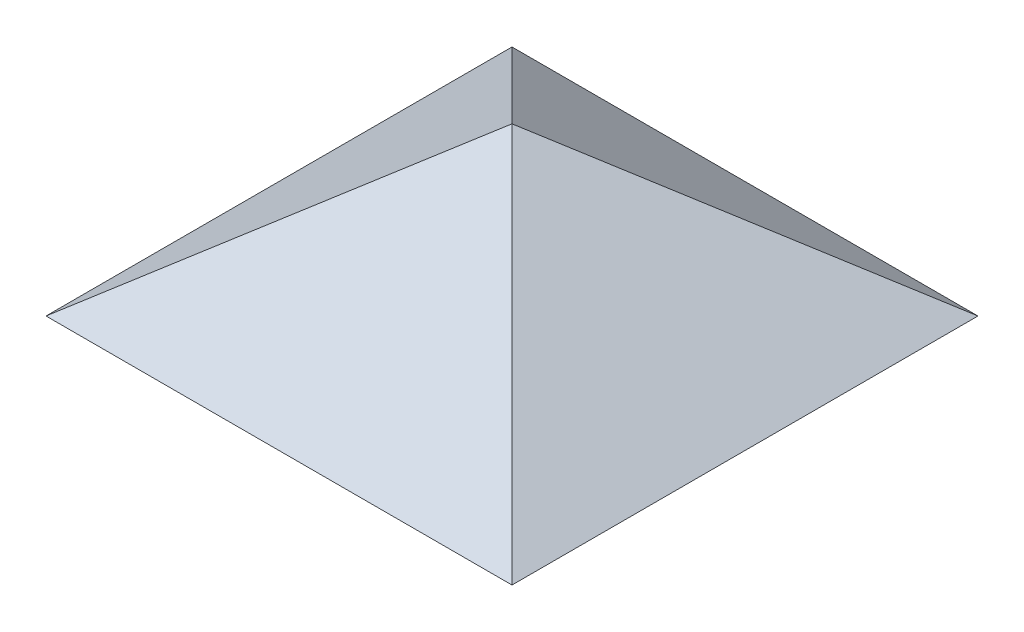
ISO-10303-21;
HEADER;
FILE_DESCRIPTION(('STEP AP214'),'2;1');
FILE_NAME('part.step','',(''),(''),'','','');
FILE_SCHEMA(('AUTOMOTIVE_DESIGN { 1 0 10303 214 1 1 1 1 }'));
ENDSEC;
DATA;
#1=APPLICATION_CONTEXT('core data for automotive mechanical design processes');
#2=APPLICATION_PROTOCOL_DEFINITION('international standard','automotive_design',2000,#1);
#3=PRODUCT_CONTEXT('',#1,'mechanical');
#4=PRODUCT('Part','Part','',(#3));
#5=PRODUCT_RELATED_PRODUCT_CATEGORY('part','',(#4));
#6=PRODUCT_DEFINITION_FORMATION('','',#4);
#7=PRODUCT_DEFINITION_CONTEXT('part definition',#1,'design');
#8=PRODUCT_DEFINITION('design','',#6,#7);
#9=PRODUCT_DEFINITION_SHAPE('','',#8);
#10=(LENGTH_UNIT() NAMED_UNIT(*) SI_UNIT(.MILLI.,.METRE.));
#11=(NAMED_UNIT(*) PLANE_ANGLE_UNIT() SI_UNIT($,.RADIAN.));
#12=(NAMED_UNIT(*) SI_UNIT($,.STERADIAN.) SOLID_ANGLE_UNIT());
#13=UNCERTAINTY_MEASURE_WITH_UNIT(LENGTH_MEASURE(1.E-05),#10,'distance_accuracy_value','');
#14=(GEOMETRIC_REPRESENTATION_CONTEXT(3) GLOBAL_UNCERTAINTY_ASSIGNED_CONTEXT((#13)) GLOBAL_UNIT_ASSIGNED_CONTEXT((#10,
#11,#12)) REPRESENTATION_CONTEXT('',''));
#15=CARTESIAN_POINT('',(0.,0.,0.));
#16=DIRECTION('',(0.,0.,1.));
#17=DIRECTION('',(1.,0.,0.));
#18=AXIS2_PLACEMENT_3D('',#15,#16,#17);
#19=CARTESIAN_POINT('',(0.,827.702702702702,-591.216216216216));
#20=DIRECTION('',(0.,-0.813733471206735,0.581238193719096));
#21=DIRECTION('',(0.,-0.581238193719096,-0.813733471206735));
#22=AXIS2_PLACEMENT_3D('',#19,#20,#21);
#23=PLANE('',#22);
#24=DIRECTION('',(1.,0.,0.));
#25=VECTOR('',#24,1.);
#26=CARTESIAN_POINT('',(-1750.,0.,-1750.));
#27=LINE('',#26,#25);
#28=CARTESIAN_POINT('',(-1750.,-4.44089209850063E-13,-1750.));
#29=VERTEX_POINT('',#28);
#30=CARTESIAN_POINT('',(1750.,0.,-1750.));
#31=VERTEX_POINT('',#30);
#32=EDGE_CURVE('E131',#29,#31,#27,.T.);
#33=ORIENTED_EDGE('',*,*,#32,.F.);
#34=DIRECTION('',(-0.631168744267202,-0.450834817333716,-0.631168744267203));
#35=VECTOR('',#34,1.);
#36=CARTESIAN_POINT('',(0.,1250.,0.));
#37=LINE('',#36,#35);
#38=CARTESIAN_POINT('',(0.,1250.,0.));
#39=VERTEX_POINT('',#38);
#40=EDGE_CURVE('E13',#39,#29,#37,.T.);
#41=ORIENTED_EDGE('',*,*,#40,.F.);
#42=DIRECTION('',(-0.631168744267203,0.450834817333716,0.631168744267203));
#43=VECTOR('',#42,1.);
#44=CARTESIAN_POINT('',(0.,1250.,0.));
#45=LINE('',#44,#43);
#46=EDGE_CURVE('E81',#31,#39,#45,.T.);
#47=ORIENTED_EDGE('',*,*,#46,.F.);
#48=EDGE_LOOP('',(#33,#41,#47));
#49=FACE_BOUND('',#48,.T.);
#50=ADVANCED_FACE('F71',(#49),#23,.F.);
#51=CARTESIAN_POINT('',(0.,649.500384319754,-624.519600307456));
#52=DIRECTION('',(0.,-0.720833064901856,0.693108716251784));
#53=DIRECTION('',(0.,-0.693108716251784,-0.720833064901856));
#54=AXIS2_PLACEMENT_3D('',#51,#52,#53);
#55=PLANE('',#54);
#56=DIRECTION('',(1.,0.,0.));
#57=VECTOR('',#56,1.);
#58=CARTESIAN_POINT('',(-1300.,0.,-1300.));
#59=LINE('',#58,#57);
#60=CARTESIAN_POINT('',(-1300.,0.,-1300.));
#61=VERTEX_POINT('',#60);
#62=CARTESIAN_POINT('',(1300.,2.22044604925031E-13,-1300.));
#63=VERTEX_POINT('',#62);
#64=EDGE_CURVE('E111',#61,#63,#59,.T.);
#65=ORIENTED_EDGE('',*,*,#64,.T.);
#66=DIRECTION('',(-0.584749707598188,0.562259334229027,0.584749707598188));
#67=VECTOR('',#66,1.);
#68=CARTESIAN_POINT('',(0.,1250.,0.));
#69=LINE('',#68,#67);
#70=EDGE_CURVE('E114',#63,#39,#69,.T.);
#71=ORIENTED_EDGE('',*,*,#70,.T.);
#72=DIRECTION('',(-0.584749707598188,-0.562259334229027,-0.584749707598188));
#73=VECTOR('',#72,1.);
#74=CARTESIAN_POINT('',(0.,1250.,0.));
#75=LINE('',#74,#73);
#76=EDGE_CURVE('E108',#39,#61,#75,.T.);
#77=ORIENTED_EDGE('',*,*,#76,.T.);
#78=EDGE_LOOP('',(#65,#71,#77));
#79=FACE_BOUND('',#78,.T.);
#80=ADVANCED_FACE('F110',(#79),#55,.T.);
#81=CARTESIAN_POINT('',(0.,8.63506796930678E-13,0.));
#82=DIRECTION('',(0.,-1.,0.));
#83=DIRECTION('',(0.,0.,-1.));
#84=AXIS2_PLACEMENT_3D('',#81,#82,#83);
#85=PLANE('',#84);
#86=DIRECTION('',(-0.707106781186547,0.,-0.707106781186548));
#87=VECTOR('',#86,1.);
#88=CARTESIAN_POINT('',(-1300.,0.,-1300.));
#89=LINE('',#88,#87);
#90=EDGE_CURVE('E96',#61,#29,#89,.T.);
#91=ORIENTED_EDGE('',*,*,#90,.T.);
#92=ORIENTED_EDGE('',*,*,#32,.T.);
#93=DIRECTION('',(0.707106781186548,0.,-0.707106781186547));
#94=VECTOR('',#93,1.);
#95=CARTESIAN_POINT('',(1300.,2.22044604925031E-13,-1300.));
#96=LINE('',#95,#94);
#97=EDGE_CURVE('E124',#63,#31,#96,.T.);
#98=ORIENTED_EDGE('',*,*,#97,.F.);
#99=ORIENTED_EDGE('',*,*,#64,.F.);
#100=EDGE_LOOP('',(#91,#92,#98,#99));
#101=FACE_BOUND('',#100,.T.);
#102=ADVANCED_FACE('F122',(#101),#85,.T.);
#103=CARTESIAN_POINT('',(0.,1250.,0.));
#104=DIRECTION('',(0.707106781186547,0.,0.707106781186548));
#105=DIRECTION('',(0.584749707598188,-0.562259334229026,-0.584749707598188));
#106=AXIS2_PLACEMENT_3D('',#103,#104,#105);
#107=PLANE('',#106);
#108=ORIENTED_EDGE('',*,*,#70,.F.);
#109=ORIENTED_EDGE('',*,*,#97,.T.);
#110=ORIENTED_EDGE('',*,*,#46,.T.);
#111=EDGE_LOOP('',(#108,#109,#110));
#112=FACE_BOUND('',#111,.T.);
#113=ADVANCED_FACE('F144',(#112),#107,.T.);
#114=CARTESIAN_POINT('',(-1300.,0.,-1300.));
#115=DIRECTION('',(-0.707106781186548,0.,0.707106781186547));
#116=DIRECTION('',(0.584749707598188,0.562259334229027,0.584749707598188));
#117=AXIS2_PLACEMENT_3D('',#114,#115,#116);
#118=PLANE('',#117);
#119=ORIENTED_EDGE('',*,*,#76,.F.);
#120=ORIENTED_EDGE('',*,*,#40,.T.);
#121=ORIENTED_EDGE('',*,*,#90,.F.);
#122=EDGE_LOOP('',(#119,#120,#121));
#123=FACE_BOUND('',#122,.T.);
#124=ADVANCED_FACE('F128',(#123),#118,.T.);
#125=CLOSED_SHELL('',(#50,#80,#102,#113,#124));
#126=MANIFOLD_SOLID_BREP('B2',#125);
#127=CARTESIAN_POINT('',(0.,649.500384319754,624.519600307456));
#128=DIRECTION('',(0.,0.720833064901856,0.693108716251784));
#129=DIRECTION('',(0.,-0.693108716251784,0.720833064901856));
#130=AXIS2_PLACEMENT_3D('',#127,#128,#129);
#131=PLANE('',#130);
#132=DIRECTION('',(1.,0.,0.));
#133=VECTOR('',#132,1.);
#134=CARTESIAN_POINT('',(-1300.,0.,1300.));
#135=LINE('',#134,#133);
#136=CARTESIAN_POINT('',(-1300.,0.,1300.));
#137=VERTEX_POINT('',#136);
#138=CARTESIAN_POINT('',(1300.,0.,1300.));
#139=VERTEX_POINT('',#138);
#140=EDGE_CURVE('E479',#137,#139,#135,.T.);
#141=ORIENTED_EDGE('',*,*,#140,.F.);
#142=DIRECTION('',(-0.584749707598188,-0.562259334229027,0.584749707598188));
#143=VECTOR('',#142,1.);
#144=CARTESIAN_POINT('',(0.,1250.,0.));
#145=LINE('',#144,#143);
#146=CARTESIAN_POINT('',(0.,1250.,0.));
#147=VERTEX_POINT('',#146);
#148=EDGE_CURVE('E69',#147,#137,#145,.T.);
#149=ORIENTED_EDGE('',*,*,#148,.F.);
#150=DIRECTION('',(-0.584749707598187,0.562259334229027,-0.584749707598188));
#151=VECTOR('',#150,1.);
#152=CARTESIAN_POINT('',(0.,1250.,0.));
#153=LINE('',#152,#151);
#154=EDGE_CURVE('E309',#139,#147,#153,.T.);
#155=ORIENTED_EDGE('',*,*,#154,.F.);
#156=EDGE_LOOP('',(#141,#149,#155));
#157=FACE_BOUND('',#156,.T.);
#158=ADVANCED_FACE('F299',(#157),#131,.F.);
#159=CARTESIAN_POINT('',(1.15335668943323E-13,827.702702702703,591.216216216216));
#160=DIRECTION('',(0.,-0.813733471206735,-0.581238193719096));
#161=DIRECTION('',(0.,0.581238193719096,-0.813733471206735));
#162=AXIS2_PLACEMENT_3D('',#159,#160,#161);
#163=PLANE('',#162);
#164=DIRECTION('',(-0.631168744267203,-0.450834817333716,0.631168744267203));
#165=VECTOR('',#164,1.);
#166=CARTESIAN_POINT('',(0.,1250.,0.));
#167=LINE('',#166,#165);
#168=CARTESIAN_POINT('',(-1750.,0.,1750.));
#169=VERTEX_POINT('',#168);
#170=EDGE_CURVE('E418',#147,#169,#167,.T.);
#171=ORIENTED_EDGE('',*,*,#170,.T.);
#172=DIRECTION('',(1.,0.,0.));
#173=VECTOR('',#172,1.);
#174=CARTESIAN_POINT('',(-1750.,0.,1750.));
#175=LINE('',#174,#173);
#176=CARTESIAN_POINT('',(1750.,-2.22044604925031E-13,1750.));
#177=VERTEX_POINT('',#176);
#178=EDGE_CURVE('E317',#169,#177,#175,.T.);
#179=ORIENTED_EDGE('',*,*,#178,.T.);
#180=DIRECTION('',(-0.631168744267202,0.450834817333716,-0.631168744267203));
#181=VECTOR('',#180,1.);
#182=CARTESIAN_POINT('',(0.,1250.,0.));
#183=LINE('',#182,#181);
#184=EDGE_CURVE('E326',#177,#147,#183,.T.);
#185=ORIENTED_EDGE('',*,*,#184,.T.);
#186=EDGE_LOOP('',(#171,#179,#185));
#187=FACE_BOUND('',#186,.T.);
#188=ADVANCED_FACE('F435',(#187),#163,.F.);
#189=CARTESIAN_POINT('',(-1750.,0.,1750.));
#190=DIRECTION('',(0.,1.,0.));
#191=DIRECTION('',(0.,0.,1.));
#192=AXIS2_PLACEMENT_3D('',#189,#190,#191);
#193=PLANE('',#192);
#194=ORIENTED_EDGE('',*,*,#140,.T.);
#195=DIRECTION('',(0.,0.,1.));
#196=VECTOR('',#195,1.);
#197=CARTESIAN_POINT('',(1300.,0.,-1300.));
#198=LINE('',#197,#196);
#199=CARTESIAN_POINT('',(1300.,0.,-1300.));
#200=VERTEX_POINT('',#199);
#201=EDGE_CURVE('E353',#200,#139,#198,.T.);
#202=ORIENTED_EDGE('',*,*,#201,.F.);
#203=DIRECTION('',(-0.707106781186548,0.,0.707106781186548));
#204=VECTOR('',#203,1.);
#205=CARTESIAN_POINT('',(1750.,0.,-1750.));
#206=LINE('',#205,#204);
#207=CARTESIAN_POINT('',(1750.,0.,-1750.));
#208=VERTEX_POINT('',#207);
#209=EDGE_CURVE('E348',#208,#200,#206,.T.);
#210=ORIENTED_EDGE('',*,*,#209,.F.);
#211=DIRECTION('',(0.,0.,1.));
#212=VECTOR('',#211,1.);
#213=CARTESIAN_POINT('',(1750.,0.,-1750.));
#214=LINE('',#213,#212);
#215=EDGE_CURVE('E352',#208,#177,#214,.T.);
#216=ORIENTED_EDGE('',*,*,#215,.T.);
#217=ORIENTED_EDGE('',*,*,#178,.F.);
#218=DIRECTION('',(0.,0.,-1.));
#219=VECTOR('',#218,1.);
#220=CARTESIAN_POINT('',(-1750.,0.,1750.));
#221=LINE('',#220,#219);
#222=CARTESIAN_POINT('',(-1750.,-2.22044604925031E-13,-1750.));
#223=VERTEX_POINT('',#222);
#224=EDGE_CURVE('E484',#169,#223,#221,.T.);
#225=ORIENTED_EDGE('',*,*,#224,.T.);
#226=DIRECTION('',(-0.707106781186548,0.,-0.707106781186548));
#227=VECTOR('',#226,1.);
#228=CARTESIAN_POINT('',(0.,0.,1.11022302462516E-12));
#229=LINE('',#228,#227);
#230=CARTESIAN_POINT('',(-1300.,0.,-1300.));
#231=VERTEX_POINT('',#230);
#232=EDGE_CURVE('E483',#231,#223,#229,.T.);
#233=ORIENTED_EDGE('',*,*,#232,.F.);
#234=DIRECTION('',(0.,0.,-1.));
#235=VECTOR('',#234,1.);
#236=CARTESIAN_POINT('',(-1300.,0.,1300.));
#237=LINE('',#236,#235);
#238=EDGE_CURVE('E499',#137,#231,#237,.T.);
#239=ORIENTED_EDGE('',*,*,#238,.F.);
#240=EDGE_LOOP('',(#194,#202,#210,#216,#217,#225,#233,#239));
#241=FACE_BOUND('',#240,.T.);
#242=ADVANCED_FACE('F351',(#241),#193,.F.);
#243=CARTESIAN_POINT('',(-624.519600307456,649.500384319754,1.38671207918207E-13));
#244=DIRECTION('',(-0.693108716251784,0.720833064901856,0.));
#245=DIRECTION('',(-0.720833064901856,-0.693108716251784,0.));
#246=AXIS2_PLACEMENT_3D('',#243,#244,#245);
#247=PLANE('',#246);
#248=ORIENTED_EDGE('',*,*,#238,.T.);
#249=DIRECTION('',(0.584749707598188,0.562259334229027,0.584749707598187));
#250=VECTOR('',#249,1.);
#251=CARTESIAN_POINT('',(0.,1250.,0.));
#252=LINE('',#251,#250);
#253=EDGE_CURVE('E530',#231,#147,#252,.T.);
#254=ORIENTED_EDGE('',*,*,#253,.T.);
#255=ORIENTED_EDGE('',*,*,#148,.T.);
#256=EDGE_LOOP('',(#248,#254,#255));
#257=FACE_BOUND('',#256,.T.);
#258=ADVANCED_FACE('F444',(#257),#247,.F.);
#259=CARTESIAN_POINT('',(-591.216216216216,827.702702702703,0.));
#260=DIRECTION('',(0.581238193719096,-0.813733471206735,0.));
#261=DIRECTION('',(0.813733471206735,0.581238193719096,0.));
#262=AXIS2_PLACEMENT_3D('',#259,#260,#261);
#263=PLANE('',#262);
#264=ORIENTED_EDGE('',*,*,#170,.F.);
#265=DIRECTION('',(0.631168744267203,0.450834817333716,0.631168744267202));
#266=VECTOR('',#265,1.);
#267=CARTESIAN_POINT('',(0.,1250.,0.));
#268=LINE('',#267,#266);
#269=EDGE_CURVE('E480',#223,#147,#268,.T.);
#270=ORIENTED_EDGE('',*,*,#269,.F.);
#271=ORIENTED_EDGE('',*,*,#224,.F.);
#272=EDGE_LOOP('',(#264,#270,#271));
#273=FACE_BOUND('',#272,.T.);
#274=ADVANCED_FACE('F524',(#273),#263,.F.);
#275=CARTESIAN_POINT('',(-4.71027737605132E-13,0.,4.71027737605132E-13));
#276=DIRECTION('',(-0.707106781186547,0.,0.707106781186547));
#277=DIRECTION('',(-0.707106781186548,0.,-0.707106781186548));
#278=AXIS2_PLACEMENT_3D('',#275,#276,#277);
#279=PLANE('',#278);
#280=ORIENTED_EDGE('',*,*,#232,.T.);
#281=ORIENTED_EDGE('',*,*,#269,.T.);
#282=ORIENTED_EDGE('',*,*,#253,.F.);
#283=EDGE_LOOP('',(#280,#281,#282));
#284=FACE_BOUND('',#283,.T.);
#285=ADVANCED_FACE('F529',(#284),#279,.F.);
#286=CARTESIAN_POINT('',(624.519600307456,649.500384319754,1.38671207918207E-13));
#287=DIRECTION('',(0.693108716251784,0.720833064901856,0.));
#288=DIRECTION('',(0.720833064901856,-0.693108716251784,0.));
#289=AXIS2_PLACEMENT_3D('',#286,#287,#288);
#290=PLANE('',#289);
#291=ORIENTED_EDGE('',*,*,#201,.T.);
#292=ORIENTED_EDGE('',*,*,#154,.T.);
#293=DIRECTION('',(0.584749707598188,-0.562259334229027,-0.584749707598187));
#294=VECTOR('',#293,1.);
#295=CARTESIAN_POINT('',(0.,1250.,0.));
#296=LINE('',#295,#294);
#297=EDGE_CURVE('E372',#147,#200,#296,.T.);
#298=ORIENTED_EDGE('',*,*,#297,.T.);
#299=EDGE_LOOP('',(#291,#292,#298));
#300=FACE_BOUND('',#299,.T.);
#301=ADVANCED_FACE('F394',(#300),#290,.F.);
#302=CARTESIAN_POINT('',(591.216216216216,827.702702702703,2.46612040098324E-13));
#303=DIRECTION('',(-0.581238193719096,-0.813733471206735,0.));
#304=DIRECTION('',(-0.813733471206735,0.581238193719096,0.));
#305=AXIS2_PLACEMENT_3D('',#302,#303,#304);
#306=PLANE('',#305);
#307=DIRECTION('',(0.631168744267203,-0.450834817333716,-0.631168744267202));
#308=VECTOR('',#307,1.);
#309=CARTESIAN_POINT('',(0.,1250.,0.));
#310=LINE('',#309,#308);
#311=EDGE_CURVE('E365',#147,#208,#310,.T.);
#312=ORIENTED_EDGE('',*,*,#311,.F.);
#313=ORIENTED_EDGE('',*,*,#184,.F.);
#314=ORIENTED_EDGE('',*,*,#215,.F.);
#315=EDGE_LOOP('',(#312,#313,#314));
#316=FACE_BOUND('',#315,.T.);
#317=ADVANCED_FACE('F364',(#316),#306,.F.);
#318=CARTESIAN_POINT('',(7.06541606407699E-13,0.,7.06541606407699E-13));
#319=DIRECTION('',(-0.707106781186548,0.,-0.707106781186547));
#320=DIRECTION('',(0.707106781186548,0.,-0.707106781186548));
#321=AXIS2_PLACEMENT_3D('',#318,#319,#320);
#322=PLANE('',#321);
#323=ORIENTED_EDGE('',*,*,#209,.T.);
#324=ORIENTED_EDGE('',*,*,#297,.F.);
#325=ORIENTED_EDGE('',*,*,#311,.T.);
#326=EDGE_LOOP('',(#323,#324,#325));
#327=FACE_BOUND('',#326,.T.);
#328=ADVANCED_FACE('F371',(#327),#322,.T.);
#329=CLOSED_SHELL('',(#158,#188,#242,#258,#274,#285,#301,#317,#328));
#330=MANIFOLD_SOLID_BREP('B7',#329);
#331=ADVANCED_BREP_SHAPE_REPRESENTATION('',(#18,#126,#330),#14);
#332=SHAPE_DEFINITION_REPRESENTATION(#9,#331);
ENDSEC;
END-ISO-10303-21;
